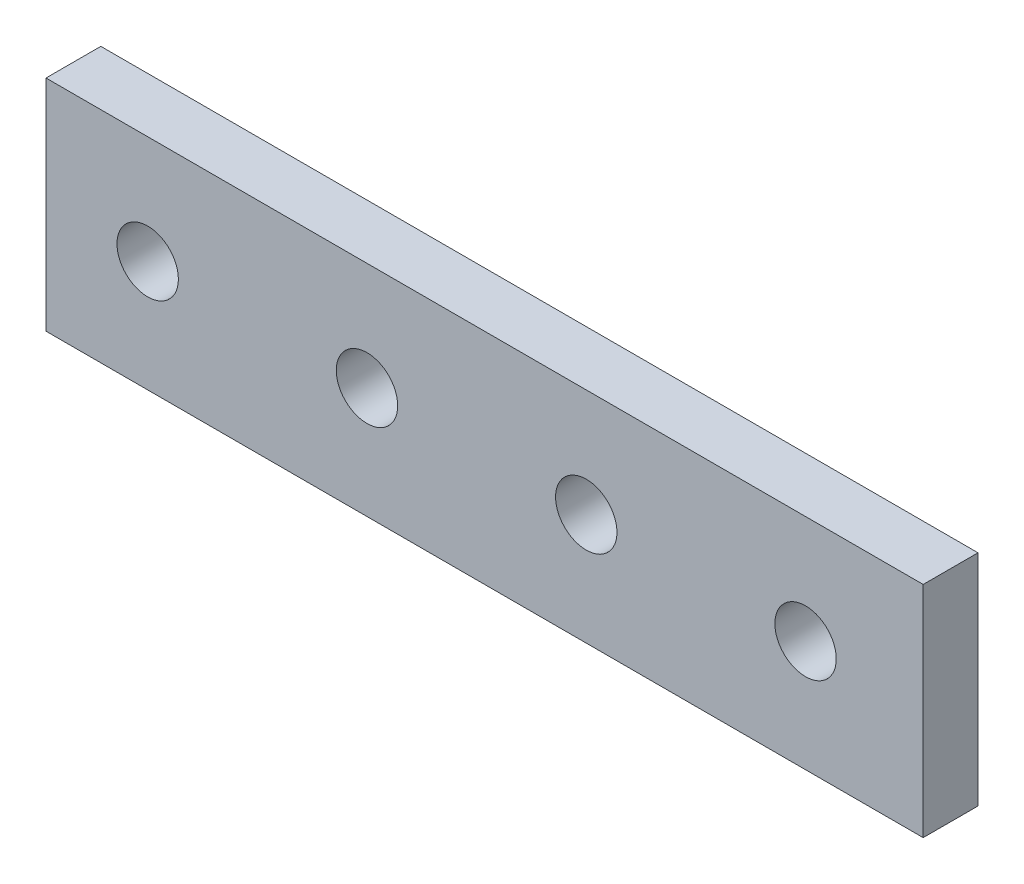
ISO-10303-21;
HEADER;
FILE_DESCRIPTION(('STEP AP214'),'2;1');
FILE_NAME('part.step','',(''),(''),'','','');
FILE_SCHEMA(('AUTOMOTIVE_DESIGN { 1 0 10303 214 1 1 1 1 }'));
ENDSEC;
DATA;
#1=APPLICATION_CONTEXT('core data for automotive mechanical design processes');
#2=APPLICATION_PROTOCOL_DEFINITION('international standard','automotive_design',2000,#1);
#3=PRODUCT_CONTEXT('',#1,'mechanical');
#4=PRODUCT('Part','Part','',(#3));
#5=PRODUCT_RELATED_PRODUCT_CATEGORY('part','',(#4));
#6=PRODUCT_DEFINITION_FORMATION('','',#4);
#7=PRODUCT_DEFINITION_CONTEXT('part definition',#1,'design');
#8=PRODUCT_DEFINITION('design','',#6,#7);
#9=PRODUCT_DEFINITION_SHAPE('','',#8);
#10=(LENGTH_UNIT() NAMED_UNIT(*) SI_UNIT(.MILLI.,.METRE.));
#11=(NAMED_UNIT(*) PLANE_ANGLE_UNIT() SI_UNIT($,.RADIAN.));
#12=(NAMED_UNIT(*) SI_UNIT($,.STERADIAN.) SOLID_ANGLE_UNIT());
#13=UNCERTAINTY_MEASURE_WITH_UNIT(LENGTH_MEASURE(1.E-05),#10,'distance_accuracy_value','');
#14=(GEOMETRIC_REPRESENTATION_CONTEXT(3) GLOBAL_UNCERTAINTY_ASSIGNED_CONTEXT((#13)) GLOBAL_UNIT_ASSIGNED_CONTEXT((#10,
#11,#12)) REPRESENTATION_CONTEXT('',''));
#15=CARTESIAN_POINT('',(0.,0.,0.));
#16=DIRECTION('',(0.,0.,1.));
#17=DIRECTION('',(1.,0.,0.));
#18=AXIS2_PLACEMENT_3D('',#15,#16,#17);
#19=CARTESIAN_POINT('',(-67.1743801613616,3.44404330804573,6.35));
#20=DIRECTION('',(1.,0.,0.));
#21=DIRECTION('',(0.,0.,-1.));
#22=AXIS2_PLACEMENT_3D('',#19,#20,#21);
#23=PLANE('',#22);
#24=DIRECTION('',(0.,-1.,0.));
#25=VECTOR('',#24,1.);
#26=CARTESIAN_POINT('',(-67.1743801613616,3.44404330804573,0.));
#27=LINE('',#26,#25);
#28=CARTESIAN_POINT('',(-67.1743801613616,3.44404330804573,0.));
#29=VERTEX_POINT('',#28);
#30=CARTESIAN_POINT('',(-67.1743801613616,-21.9559566919543,0.));
#31=VERTEX_POINT('',#30);
#32=EDGE_CURVE('E95',#29,#31,#27,.T.);
#33=ORIENTED_EDGE('',*,*,#32,.T.);
#34=DIRECTION('',(0.,0.,-1.));
#35=VECTOR('',#34,1.);
#36=CARTESIAN_POINT('',(-67.1743801613616,-21.9559566919543,6.35));
#37=LINE('',#36,#35);
#38=CARTESIAN_POINT('',(-67.1743801613616,-21.9559566919543,6.35));
#39=VERTEX_POINT('',#38);
#40=EDGE_CURVE('E11',#39,#31,#37,.T.);
#41=ORIENTED_EDGE('',*,*,#40,.F.);
#42=DIRECTION('',(0.,-1.,0.));
#43=VECTOR('',#42,1.);
#44=CARTESIAN_POINT('',(-67.1743801613616,3.44404330804573,6.35));
#45=LINE('',#44,#43);
#46=CARTESIAN_POINT('',(-67.1743801613616,3.44404330804573,6.35));
#47=VERTEX_POINT('',#46);
#48=EDGE_CURVE('E83',#47,#39,#45,.T.);
#49=ORIENTED_EDGE('',*,*,#48,.F.);
#50=DIRECTION('',(0.,0.,-1.));
#51=VECTOR('',#50,1.);
#52=CARTESIAN_POINT('',(-67.1743801613616,3.44404330804573,6.35));
#53=LINE('',#52,#51);
#54=EDGE_CURVE('E91',#47,#29,#53,.T.);
#55=ORIENTED_EDGE('',*,*,#54,.T.);
#56=EDGE_LOOP('',(#33,#41,#49,#55));
#57=FACE_BOUND('',#56,.T.);
#58=ADVANCED_FACE('F32',(#57),#23,.F.);
#59=CARTESIAN_POINT('',(-67.1743801613616,-21.9559566919543,6.35));
#60=DIRECTION('',(0.,1.,0.));
#61=DIRECTION('',(0.,0.,1.));
#62=AXIS2_PLACEMENT_3D('',#59,#60,#61);
#63=PLANE('',#62);
#64=DIRECTION('',(1.,0.,0.));
#65=VECTOR('',#64,1.);
#66=CARTESIAN_POINT('',(-67.1743801613616,-21.9559566919543,0.));
#67=LINE('',#66,#65);
#68=CARTESIAN_POINT('',(34.4256198386384,-21.9559566919543,0.));
#69=VERTEX_POINT('',#68);
#70=EDGE_CURVE('E87',#31,#69,#67,.T.);
#71=ORIENTED_EDGE('',*,*,#70,.T.);
#72=DIRECTION('',(0.,0.,-1.));
#73=VECTOR('',#72,1.);
#74=CARTESIAN_POINT('',(34.4256198386384,-21.9559566919543,6.35));
#75=LINE('',#74,#73);
#76=CARTESIAN_POINT('',(34.4256198386384,-21.9559566919543,6.35));
#77=VERTEX_POINT('',#76);
#78=EDGE_CURVE('E40',#77,#69,#75,.T.);
#79=ORIENTED_EDGE('',*,*,#78,.F.);
#80=DIRECTION('',(1.,0.,0.));
#81=VECTOR('',#80,1.);
#82=CARTESIAN_POINT('',(-67.1743801613616,-21.9559566919543,6.35));
#83=LINE('',#82,#81);
#84=EDGE_CURVE('E78',#39,#77,#83,.T.);
#85=ORIENTED_EDGE('',*,*,#84,.F.);
#86=ORIENTED_EDGE('',*,*,#40,.T.);
#87=EDGE_LOOP('',(#71,#79,#85,#86));
#88=FACE_BOUND('',#87,.T.);
#89=ADVANCED_FACE('F86',(#88),#63,.F.);
#90=CARTESIAN_POINT('',(34.4256198386384,3.44404330804573,6.35));
#91=DIRECTION('',(-1.,0.,0.));
#92=DIRECTION('',(0.,0.,1.));
#93=AXIS2_PLACEMENT_3D('',#90,#91,#92);
#94=PLANE('',#93);
#95=DIRECTION('',(0.,1.,0.));
#96=VECTOR('',#95,1.);
#97=CARTESIAN_POINT('',(34.4256198386384,3.44404330804573,0.));
#98=LINE('',#97,#96);
#99=CARTESIAN_POINT('',(34.4256198386384,3.44404330804573,0.));
#100=VERTEX_POINT('',#99);
#101=EDGE_CURVE('E65',#69,#100,#98,.T.);
#102=ORIENTED_EDGE('',*,*,#101,.T.);
#103=DIRECTION('',(0.,0.,-1.));
#104=VECTOR('',#103,1.);
#105=CARTESIAN_POINT('',(34.4256198386384,3.44404330804573,6.35));
#106=LINE('',#105,#104);
#107=CARTESIAN_POINT('',(34.4256198386384,3.44404330804573,6.35));
#108=VERTEX_POINT('',#107);
#109=EDGE_CURVE('E88',#108,#100,#106,.T.);
#110=ORIENTED_EDGE('',*,*,#109,.F.);
#111=DIRECTION('',(0.,1.,0.));
#112=VECTOR('',#111,1.);
#113=CARTESIAN_POINT('',(34.4256198386384,3.44404330804573,6.35));
#114=LINE('',#113,#112);
#115=EDGE_CURVE('E81',#77,#108,#114,.T.);
#116=ORIENTED_EDGE('',*,*,#115,.F.);
#117=ORIENTED_EDGE('',*,*,#78,.T.);
#118=EDGE_LOOP('',(#102,#110,#116,#117));
#119=FACE_BOUND('',#118,.T.);
#120=ADVANCED_FACE('F89',(#119),#94,.F.);
#121=CARTESIAN_POINT('',(-67.1743801613616,3.44404330804573,6.35));
#122=DIRECTION('',(0.,-1.,0.));
#123=DIRECTION('',(0.,0.,-1.));
#124=AXIS2_PLACEMENT_3D('',#121,#122,#123);
#125=PLANE('',#124);
#126=DIRECTION('',(-1.,0.,0.));
#127=VECTOR('',#126,1.);
#128=CARTESIAN_POINT('',(-67.1743801613616,3.44404330804573,0.));
#129=LINE('',#128,#127);
#130=EDGE_CURVE('E71',#100,#29,#129,.T.);
#131=ORIENTED_EDGE('',*,*,#130,.T.);
#132=ORIENTED_EDGE('',*,*,#54,.F.);
#133=DIRECTION('',(-1.,0.,0.));
#134=VECTOR('',#133,1.);
#135=CARTESIAN_POINT('',(-67.1743801613616,3.44404330804573,6.35));
#136=LINE('',#135,#134);
#137=EDGE_CURVE('E48',#108,#47,#136,.T.);
#138=ORIENTED_EDGE('',*,*,#137,.F.);
#139=ORIENTED_EDGE('',*,*,#109,.T.);
#140=EDGE_LOOP('',(#131,#132,#138,#139));
#141=FACE_BOUND('',#140,.T.);
#142=ADVANCED_FACE('F103',(#141),#125,.F.);
#143=CARTESIAN_POINT('',(-67.1743801613616,-21.9559566919543,6.35));
#144=DIRECTION('',(0.,0.,1.));
#145=DIRECTION('',(1.,0.,0.));
#146=AXIS2_PLACEMENT_3D('',#143,#144,#145);
#147=PLANE('',#146);
#148=CARTESIAN_POINT('',(20.80203203,-9.067376,6.35));
#149=DIRECTION('',(0.,0.,1.));
#150=DIRECTION('',(1.,0.,0.));
#151=AXIS2_PLACEMENT_3D('',#148,#149,#150);
#152=CIRCLE('',#151,3.55600000000001);
#153=CARTESIAN_POINT('',(24.35803203,-9.067376,6.35));
#154=VERTEX_POINT('',#153);
#155=EDGE_CURVE('E127',#154,#154,#152,.T.);
#156=ORIENTED_EDGE('',*,*,#155,.F.);
#157=EDGE_LOOP('',(#156));
#158=FACE_BOUND('',#157,.T.);
#159=CARTESIAN_POINT('',(-4.59796797000001,-9.067376,6.35));
#160=DIRECTION('',(0.,0.,1.));
#161=DIRECTION('',(1.,0.,0.));
#162=AXIS2_PLACEMENT_3D('',#159,#160,#161);
#163=CIRCLE('',#162,3.55600000000001);
#164=CARTESIAN_POINT('',(-1.04196797,-9.067376,6.35));
#165=VERTEX_POINT('',#164);
#166=EDGE_CURVE('E121',#165,#165,#163,.T.);
#167=ORIENTED_EDGE('',*,*,#166,.F.);
#168=EDGE_LOOP('',(#167));
#169=FACE_BOUND('',#168,.T.);
#170=CARTESIAN_POINT('',(-29.99796797,-9.067376,6.35));
#171=DIRECTION('',(0.,0.,1.));
#172=DIRECTION('',(1.,0.,0.));
#173=AXIS2_PLACEMENT_3D('',#170,#171,#172);
#174=CIRCLE('',#173,3.55600000000001);
#175=CARTESIAN_POINT('',(-26.44196797,-9.067376,6.35));
#176=VERTEX_POINT('',#175);
#177=EDGE_CURVE('E115',#176,#176,#174,.T.);
#178=ORIENTED_EDGE('',*,*,#177,.F.);
#179=EDGE_LOOP('',(#178));
#180=FACE_BOUND('',#179,.T.);
#181=CARTESIAN_POINT('',(-55.39796797,-9.067376,6.35));
#182=DIRECTION('',(0.,0.,1.));
#183=DIRECTION('',(1.,0.,0.));
#184=AXIS2_PLACEMENT_3D('',#181,#182,#183);
#185=CIRCLE('',#184,3.55600000000001);
#186=CARTESIAN_POINT('',(-51.84196797,-9.067376,6.35));
#187=VERTEX_POINT('',#186);
#188=EDGE_CURVE('E109',#187,#187,#185,.T.);
#189=ORIENTED_EDGE('',*,*,#188,.F.);
#190=EDGE_LOOP('',(#189));
#191=FACE_BOUND('',#190,.T.);
#192=ORIENTED_EDGE('',*,*,#48,.T.);
#193=ORIENTED_EDGE('',*,*,#84,.T.);
#194=ORIENTED_EDGE('',*,*,#115,.T.);
#195=ORIENTED_EDGE('',*,*,#137,.T.);
#196=EDGE_LOOP('',(#192,#193,#194,#195));
#197=FACE_BOUND('',#196,.T.);
#198=ADVANCED_FACE('F79',(#158,#169,#180,#191,#197),#147,.T.);
#199=CARTESIAN_POINT('',(-67.1743801613616,-21.9559566919543,0.));
#200=DIRECTION('',(0.,0.,1.));
#201=DIRECTION('',(1.,0.,0.));
#202=AXIS2_PLACEMENT_3D('',#199,#200,#201);
#203=PLANE('',#202);
#204=CARTESIAN_POINT('',(20.80203203,-9.067376,0.));
#205=DIRECTION('',(0.,0.,1.));
#206=DIRECTION('',(1.,0.,0.));
#207=AXIS2_PLACEMENT_3D('',#204,#205,#206);
#208=CIRCLE('',#207,3.55600000000001);
#209=CARTESIAN_POINT('',(24.35803203,-9.067376,0.));
#210=VERTEX_POINT('',#209);
#211=EDGE_CURVE('E124',#210,#210,#208,.T.);
#212=ORIENTED_EDGE('',*,*,#211,.T.);
#213=EDGE_LOOP('',(#212));
#214=FACE_BOUND('',#213,.T.);
#215=CARTESIAN_POINT('',(-4.59796797000001,-9.067376,0.));
#216=DIRECTION('',(0.,0.,1.));
#217=DIRECTION('',(1.,0.,0.));
#218=AXIS2_PLACEMENT_3D('',#215,#216,#217);
#219=CIRCLE('',#218,3.55600000000001);
#220=CARTESIAN_POINT('',(-1.04196797,-9.067376,0.));
#221=VERTEX_POINT('',#220);
#222=EDGE_CURVE('E118',#221,#221,#219,.T.);
#223=ORIENTED_EDGE('',*,*,#222,.T.);
#224=EDGE_LOOP('',(#223));
#225=FACE_BOUND('',#224,.T.);
#226=CARTESIAN_POINT('',(-29.99796797,-9.067376,0.));
#227=DIRECTION('',(0.,0.,1.));
#228=DIRECTION('',(1.,0.,0.));
#229=AXIS2_PLACEMENT_3D('',#226,#227,#228);
#230=CIRCLE('',#229,3.55600000000001);
#231=CARTESIAN_POINT('',(-26.44196797,-9.067376,0.));
#232=VERTEX_POINT('',#231);
#233=EDGE_CURVE('E112',#232,#232,#230,.T.);
#234=ORIENTED_EDGE('',*,*,#233,.T.);
#235=EDGE_LOOP('',(#234));
#236=FACE_BOUND('',#235,.T.);
#237=CARTESIAN_POINT('',(-55.39796797,-9.067376,0.));
#238=DIRECTION('',(0.,0.,1.));
#239=DIRECTION('',(1.,0.,0.));
#240=AXIS2_PLACEMENT_3D('',#237,#238,#239);
#241=CIRCLE('',#240,3.55600000000001);
#242=CARTESIAN_POINT('',(-51.84196797,-9.067376,0.));
#243=VERTEX_POINT('',#242);
#244=EDGE_CURVE('E98',#243,#243,#241,.T.);
#245=ORIENTED_EDGE('',*,*,#244,.T.);
#246=EDGE_LOOP('',(#245));
#247=FACE_BOUND('',#246,.T.);
#248=ORIENTED_EDGE('',*,*,#32,.F.);
#249=ORIENTED_EDGE('',*,*,#130,.F.);
#250=ORIENTED_EDGE('',*,*,#101,.F.);
#251=ORIENTED_EDGE('',*,*,#70,.F.);
#252=EDGE_LOOP('',(#248,#249,#250,#251));
#253=FACE_BOUND('',#252,.T.);
#254=ADVANCED_FACE('F106',(#214,#225,#236,#247,#253),#203,.F.);
#255=CARTESIAN_POINT('',(-55.39796797,-9.067376,0.));
#256=DIRECTION('',(0.,0.,1.));
#257=DIRECTION('',(1.,0.,0.));
#258=AXIS2_PLACEMENT_3D('',#255,#256,#257);
#259=CYLINDRICAL_SURFACE('',#258,3.55600000000001);
#260=ORIENTED_EDGE('',*,*,#244,.F.);
#261=EDGE_LOOP('',(#260));
#262=FACE_BOUND('',#261,.T.);
#263=ORIENTED_EDGE('',*,*,#188,.T.);
#264=EDGE_LOOP('',(#263));
#265=FACE_BOUND('',#264,.T.);
#266=ADVANCED_FACE('F151',(#262,#265),#259,.F.);
#267=CARTESIAN_POINT('',(-29.99796797,-9.067376,0.));
#268=DIRECTION('',(0.,0.,1.));
#269=DIRECTION('',(1.,0.,0.));
#270=AXIS2_PLACEMENT_3D('',#267,#268,#269);
#271=CYLINDRICAL_SURFACE('',#270,3.55600000000001);
#272=ORIENTED_EDGE('',*,*,#233,.F.);
#273=EDGE_LOOP('',(#272));
#274=FACE_BOUND('',#273,.T.);
#275=ORIENTED_EDGE('',*,*,#177,.T.);
#276=EDGE_LOOP('',(#275));
#277=FACE_BOUND('',#276,.T.);
#278=ADVANCED_FACE('F153',(#274,#277),#271,.F.);
#279=CARTESIAN_POINT('',(-4.59796797000001,-9.067376,0.));
#280=DIRECTION('',(0.,0.,1.));
#281=DIRECTION('',(1.,0.,0.));
#282=AXIS2_PLACEMENT_3D('',#279,#280,#281);
#283=CYLINDRICAL_SURFACE('',#282,3.55600000000001);
#284=ORIENTED_EDGE('',*,*,#222,.F.);
#285=EDGE_LOOP('',(#284));
#286=FACE_BOUND('',#285,.T.);
#287=ORIENTED_EDGE('',*,*,#166,.T.);
#288=EDGE_LOOP('',(#287));
#289=FACE_BOUND('',#288,.T.);
#290=ADVANCED_FACE('F138',(#286,#289),#283,.F.);
#291=CARTESIAN_POINT('',(20.80203203,-9.067376,0.));
#292=DIRECTION('',(0.,0.,1.));
#293=DIRECTION('',(1.,0.,0.));
#294=AXIS2_PLACEMENT_3D('',#291,#292,#293);
#295=CYLINDRICAL_SURFACE('',#294,3.55600000000001);
#296=ORIENTED_EDGE('',*,*,#211,.F.);
#297=EDGE_LOOP('',(#296));
#298=FACE_BOUND('',#297,.T.);
#299=ORIENTED_EDGE('',*,*,#155,.T.);
#300=EDGE_LOOP('',(#299));
#301=FACE_BOUND('',#300,.T.);
#302=ADVANCED_FACE('F135',(#298,#301),#295,.F.);
#303=CLOSED_SHELL('',(#58,#89,#120,#142,#198,#254,#266,#278,#290,#302));
#304=MANIFOLD_SOLID_BREP('B2',#303);
#305=ADVANCED_BREP_SHAPE_REPRESENTATION('',(#18,#304),#14);
#306=SHAPE_DEFINITION_REPRESENTATION(#9,#305);
ENDSEC;
END-ISO-10303-21;
